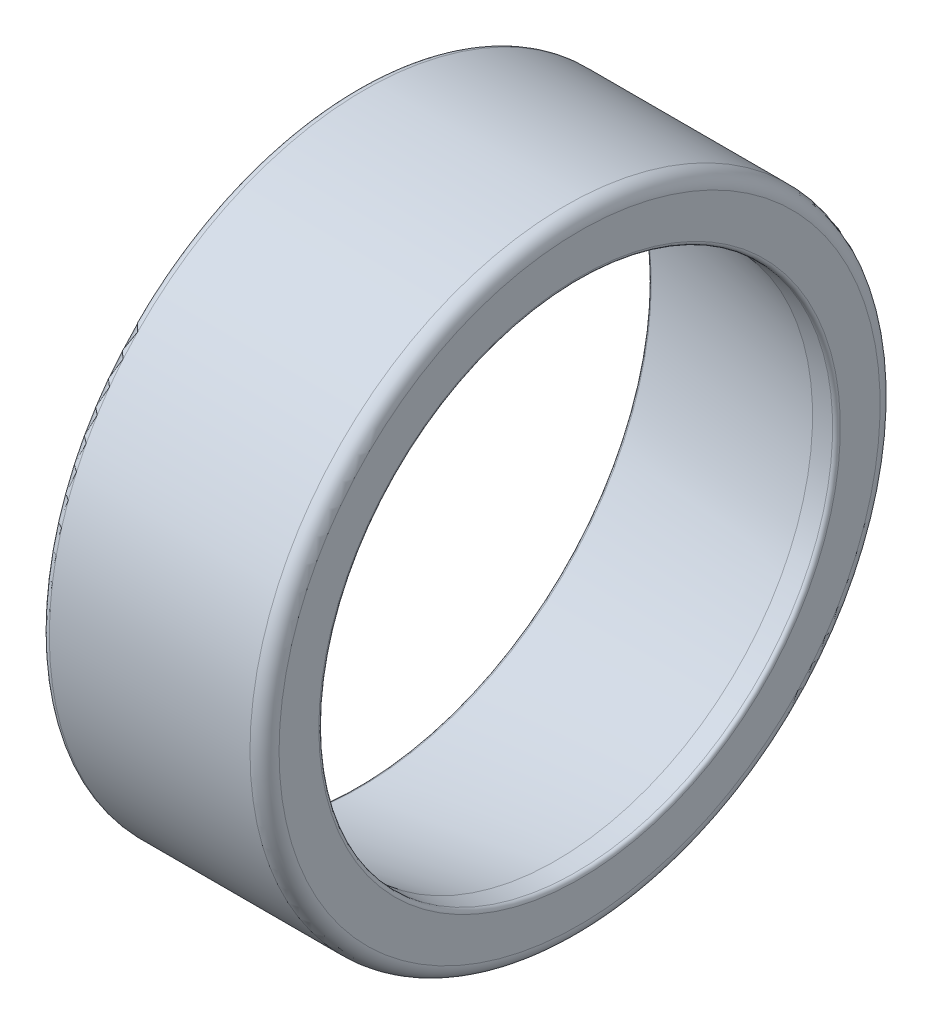
ISO-10303-21;
HEADER;
FILE_DESCRIPTION(('STEP AP214'),'2;1');
FILE_NAME('part.step','',(''),(''),'','','');
FILE_SCHEMA(('AUTOMOTIVE_DESIGN { 1 0 10303 214 1 1 1 1 }'));
ENDSEC;
DATA;
#1=APPLICATION_CONTEXT('core data for automotive mechanical design processes');
#2=APPLICATION_PROTOCOL_DEFINITION('international standard','automotive_design',2000,#1);
#3=PRODUCT_CONTEXT('',#1,'mechanical');
#4=PRODUCT('Part','Part','',(#3));
#5=PRODUCT_RELATED_PRODUCT_CATEGORY('part','',(#4));
#6=PRODUCT_DEFINITION_FORMATION('','',#4);
#7=PRODUCT_DEFINITION_CONTEXT('part definition',#1,'design');
#8=PRODUCT_DEFINITION('design','',#6,#7);
#9=PRODUCT_DEFINITION_SHAPE('','',#8);
#10=(LENGTH_UNIT() NAMED_UNIT(*) SI_UNIT(.MILLI.,.METRE.));
#11=(NAMED_UNIT(*) PLANE_ANGLE_UNIT() SI_UNIT($,.RADIAN.));
#12=(NAMED_UNIT(*) SI_UNIT($,.STERADIAN.) SOLID_ANGLE_UNIT());
#13=UNCERTAINTY_MEASURE_WITH_UNIT(LENGTH_MEASURE(1.E-05),#10,'distance_accuracy_value','');
#14=(GEOMETRIC_REPRESENTATION_CONTEXT(3) GLOBAL_UNCERTAINTY_ASSIGNED_CONTEXT((#13)) GLOBAL_UNIT_ASSIGNED_CONTEXT((#10,
#11,#12)) REPRESENTATION_CONTEXT('',''));
#15=CARTESIAN_POINT('',(0.,0.,0.));
#16=DIRECTION('',(0.,0.,1.));
#17=DIRECTION('',(1.,0.,0.));
#18=AXIS2_PLACEMENT_3D('',#15,#16,#17);
#19=CARTESIAN_POINT('',(-0.999999999999997,30.1203265422248,0.));
#20=DIRECTION('',(1.,0.,0.));
#21=DIRECTION('',(0.,0.,-1.));
#22=AXIS2_PLACEMENT_3D('',#19,#20,#21);
#23=PLANE('',#22);
#24=CARTESIAN_POINT('',(-0.999999999999997,0.,0.));
#25=DIRECTION('',(1.,0.,0.));
#26=DIRECTION('',(0.,0.,-1.));
#27=AXIS2_PLACEMENT_3D('',#24,#25,#26);
#28=CIRCLE('',#27,30.4559663946956);
#29=CARTESIAN_POINT('',(-0.999999999999997,0.,-30.4559663946956));
#30=VERTEX_POINT('',#29);
#31=EDGE_CURVE('E44',#30,#30,#28,.T.);
#32=ORIENTED_EDGE('',*,*,#31,.T.);
#33=EDGE_LOOP('',(#32));
#34=FACE_BOUND('',#33,.T.);
#35=CARTESIAN_POINT('',(-0.999999999999997,0.,0.));
#36=DIRECTION('',(1.,0.,0.));
#37=DIRECTION('',(0.,0.,-1.));
#38=AXIS2_PLACEMENT_3D('',#35,#36,#37);
#39=CIRCLE('',#38,31.7);
#40=CARTESIAN_POINT('',(-0.999999999999997,0.,-31.7));
#41=VERTEX_POINT('',#40);
#42=EDGE_CURVE('E56',#41,#41,#39,.F.);
#43=ORIENTED_EDGE('',*,*,#42,.T.);
#44=EDGE_LOOP('',(#43));
#45=FACE_BOUND('',#44,.T.);
#46=ADVANCED_FACE('F33',(#34,#45),#23,.F.);
#47=CARTESIAN_POINT('',(-0.999999999999997,0.,0.));
#48=DIRECTION('',(-1.,0.,0.));
#49=DIRECTION('',(0.,0.,1.));
#50=AXIS2_PLACEMENT_3D('',#47,#48,#49);
#51=CONICAL_SURFACE('',#50,30.1203265422248,0.174532925199532);
#52=CARTESIAN_POINT('',(-0.669459271066791,0.,0.));
#53=DIRECTION('',(1.,0.,0.));
#54=DIRECTION('',(0.,0.,-1.));
#55=AXIS2_PLACEMENT_3D('',#52,#53,#54);
#56=CIRCLE('',#55,30.0620432934908);
#57=CARTESIAN_POINT('',(-0.669459271066791,0.,-30.0620432934908));
#58=VERTEX_POINT('',#57);
#59=EDGE_CURVE('E48',#58,#58,#56,.F.);
#60=ORIENTED_EDGE('',*,*,#59,.T.);
#61=EDGE_LOOP('',(#60));
#62=FACE_BOUND('',#61,.T.);
#63=CARTESIAN_POINT('',(19.5318920999869,0.,0.));
#64=DIRECTION('',(-1.,0.,0.));
#65=DIRECTION('',(0.,0.,1.));
#66=AXIS2_PLACEMENT_3D('',#63,#64,#65);
#67=CIRCLE('',#66,26.5);
#68=CARTESIAN_POINT('',(19.5318920999869,0.,26.5));
#69=VERTEX_POINT('',#68);
#70=EDGE_CURVE('E65',#69,#69,#67,.T.);
#71=ORIENTED_EDGE('',*,*,#70,.F.);
#72=EDGE_LOOP('',(#71));
#73=FACE_BOUND('',#72,.T.);
#74=ADVANCED_FACE('F71',(#62,#73),#51,.F.);
#75=CARTESIAN_POINT('',(0.,0.,0.));
#76=DIRECTION('',(-1.,0.,0.));
#77=DIRECTION('',(0.,0.,1.));
#78=AXIS2_PLACEMENT_3D('',#75,#76,#77);
#79=CYLINDRICAL_SURFACE('',#78,26.5);
#80=CARTESIAN_POINT('',(21.6,0.,0.));
#81=DIRECTION('',(-1.,0.,0.));
#82=DIRECTION('',(0.,0.,1.));
#83=AXIS2_PLACEMENT_3D('',#80,#81,#82);
#84=CIRCLE('',#83,26.5);
#85=CARTESIAN_POINT('',(21.6,0.,26.5));
#86=VERTEX_POINT('',#85);
#87=EDGE_CURVE('E10',#86,#86,#84,.F.);
#88=ORIENTED_EDGE('',*,*,#87,.T.);
#89=EDGE_LOOP('',(#88));
#90=FACE_BOUND('',#89,.T.);
#91=ORIENTED_EDGE('',*,*,#70,.T.);
#92=EDGE_LOOP('',(#91));
#93=FACE_BOUND('',#92,.T.);
#94=ADVANCED_FACE('F69',(#90,#93),#79,.F.);
#95=CARTESIAN_POINT('',(22.,26.5,0.));
#96=DIRECTION('',(-1.,0.,0.));
#97=DIRECTION('',(0.,0.,1.));
#98=AXIS2_PLACEMENT_3D('',#95,#96,#97);
#99=PLANE('',#98);
#100=CARTESIAN_POINT('',(22.,0.,0.));
#101=DIRECTION('',(-1.,0.,0.));
#102=DIRECTION('',(0.,0.,1.));
#103=AXIS2_PLACEMENT_3D('',#100,#101,#102);
#104=CIRCLE('',#103,26.9);
#105=CARTESIAN_POINT('',(22.,0.,26.9));
#106=VERTEX_POINT('',#105);
#107=EDGE_CURVE('E40',#106,#106,#104,.T.);
#108=ORIENTED_EDGE('',*,*,#107,.T.);
#109=EDGE_LOOP('',(#108));
#110=FACE_BOUND('',#109,.T.);
#111=CARTESIAN_POINT('',(22.,0.,0.));
#112=DIRECTION('',(-1.,0.,0.));
#113=DIRECTION('',(0.,0.,1.));
#114=AXIS2_PLACEMENT_3D('',#111,#112,#113);
#115=CIRCLE('',#114,31.);
#116=CARTESIAN_POINT('',(22.,0.,31.));
#117=VERTEX_POINT('',#116);
#118=EDGE_CURVE('E59',#117,#117,#115,.F.);
#119=ORIENTED_EDGE('',*,*,#118,.T.);
#120=EDGE_LOOP('',(#119));
#121=FACE_BOUND('',#120,.T.);
#122=ADVANCED_FACE('F79',(#110,#121),#99,.F.);
#123=CARTESIAN_POINT('',(0.,0.,0.));
#124=DIRECTION('',(-1.,0.,0.));
#125=DIRECTION('',(0.,0.,1.));
#126=AXIS2_PLACEMENT_3D('',#123,#124,#125);
#127=CYLINDRICAL_SURFACE('',#126,32.5);
#128=CARTESIAN_POINT('',(-0.199999999999997,0.,0.));
#129=DIRECTION('',(1.,0.,0.));
#130=DIRECTION('',(0.,0.,-1.));
#131=AXIS2_PLACEMENT_3D('',#128,#129,#130);
#132=CIRCLE('',#131,32.5);
#133=CARTESIAN_POINT('',(-0.199999999999997,0.,-32.5));
#134=VERTEX_POINT('',#133);
#135=EDGE_CURVE('E53',#134,#134,#132,.T.);
#136=ORIENTED_EDGE('',*,*,#135,.T.);
#137=EDGE_LOOP('',(#136));
#138=FACE_BOUND('',#137,.T.);
#139=CARTESIAN_POINT('',(20.5,0.,0.));
#140=DIRECTION('',(-1.,0.,0.));
#141=DIRECTION('',(0.,0.,1.));
#142=AXIS2_PLACEMENT_3D('',#139,#140,#141);
#143=CIRCLE('',#142,32.5);
#144=CARTESIAN_POINT('',(20.5,0.,32.5));
#145=VERTEX_POINT('',#144);
#146=EDGE_CURVE('E62',#145,#145,#143,.T.);
#147=ORIENTED_EDGE('',*,*,#146,.T.);
#148=EDGE_LOOP('',(#147));
#149=FACE_BOUND('',#148,.T.);
#150=ADVANCED_FACE('F89',(#138,#149),#127,.T.);
#151=CARTESIAN_POINT('',(20.5,0.,0.));
#152=DIRECTION('',(-1.,0.,0.));
#153=DIRECTION('',(0.,0.,1.));
#154=AXIS2_PLACEMENT_3D('',#151,#152,#153);
#155=TOROIDAL_SURFACE('',#154,31.,1.5);
#156=ORIENTED_EDGE('',*,*,#118,.F.);
#157=EDGE_LOOP('',(#156));
#158=FACE_BOUND('',#157,.T.);
#159=ORIENTED_EDGE('',*,*,#146,.F.);
#160=EDGE_LOOP('',(#159));
#161=FACE_BOUND('',#160,.T.);
#162=ADVANCED_FACE('F85',(#158,#161),#155,.T.);
#163=CARTESIAN_POINT('',(-0.199999999999997,0.,0.));
#164=DIRECTION('',(1.,0.,0.));
#165=DIRECTION('',(0.,0.,-1.));
#166=AXIS2_PLACEMENT_3D('',#163,#164,#165);
#167=TOROIDAL_SURFACE('',#166,31.7,0.8);
#168=ORIENTED_EDGE('',*,*,#135,.F.);
#169=EDGE_LOOP('',(#168));
#170=FACE_BOUND('',#169,.T.);
#171=ORIENTED_EDGE('',*,*,#42,.F.);
#172=EDGE_LOOP('',(#171));
#173=FACE_BOUND('',#172,.T.);
#174=ADVANCED_FACE('F88',(#170,#173),#167,.T.);
#175=CARTESIAN_POINT('',(-0.599999999999997,0.,0.));
#176=DIRECTION('',(1.,0.,0.));
#177=DIRECTION('',(0.,0.,-1.));
#178=AXIS2_PLACEMENT_3D('',#175,#176,#177);
#179=TOROIDAL_SURFACE('',#178,30.4559663946956,0.4);
#180=ORIENTED_EDGE('',*,*,#31,.F.);
#181=EDGE_LOOP('',(#180));
#182=FACE_BOUND('',#181,.T.);
#183=ORIENTED_EDGE('',*,*,#59,.F.);
#184=EDGE_LOOP('',(#183));
#185=FACE_BOUND('',#184,.T.);
#186=ADVANCED_FACE('F92',(#182,#185),#179,.T.);
#187=CARTESIAN_POINT('',(21.6,0.,0.));
#188=DIRECTION('',(-1.,0.,0.));
#189=DIRECTION('',(0.,0.,1.));
#190=AXIS2_PLACEMENT_3D('',#187,#188,#189);
#191=TOROIDAL_SURFACE('',#190,26.9,0.4);
#192=ORIENTED_EDGE('',*,*,#87,.F.);
#193=EDGE_LOOP('',(#192));
#194=FACE_BOUND('',#193,.T.);
#195=ORIENTED_EDGE('',*,*,#107,.F.);
#196=EDGE_LOOP('',(#195));
#197=FACE_BOUND('',#196,.T.);
#198=ADVANCED_FACE('F35',(#194,#197),#191,.T.);
#199=CLOSED_SHELL('',(#46,#74,#94,#122,#150,#162,#174,#186,#198));
#200=MANIFOLD_SOLID_BREP('B2',#199);
#201=ADVANCED_BREP_SHAPE_REPRESENTATION('',(#18,#200),#14);
#202=SHAPE_DEFINITION_REPRESENTATION(#9,#201);
ENDSEC;
END-ISO-10303-21;
